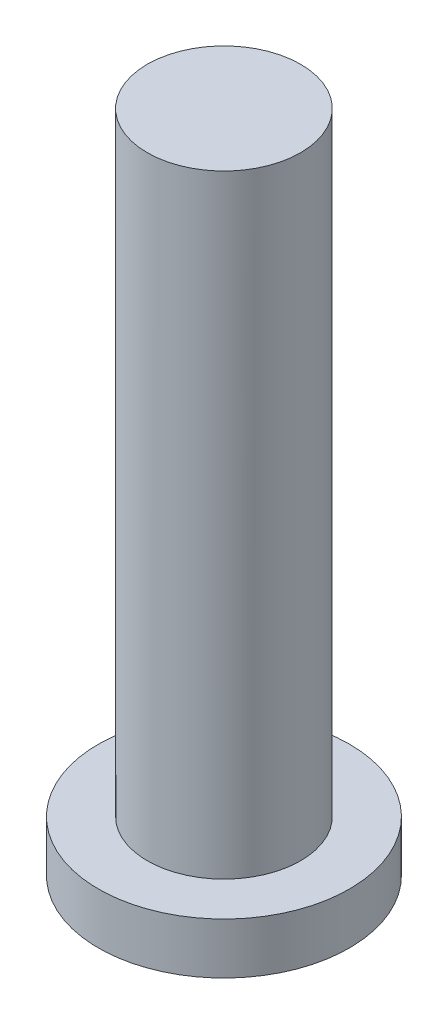
ISO-10303-21;
HEADER;
FILE_DESCRIPTION(('STEP AP214'),'2;1');
FILE_NAME('part.step','',(''),(''),'','','');
FILE_SCHEMA(('AUTOMOTIVE_DESIGN { 1 0 10303 214 1 1 1 1 }'));
ENDSEC;
DATA;
#1=APPLICATION_CONTEXT('core data for automotive mechanical design processes');
#2=APPLICATION_PROTOCOL_DEFINITION('international standard','automotive_design',2000,#1);
#3=PRODUCT_CONTEXT('',#1,'mechanical');
#4=PRODUCT('Part','Part','',(#3));
#5=PRODUCT_RELATED_PRODUCT_CATEGORY('part','',(#4));
#6=PRODUCT_DEFINITION_FORMATION('','',#4);
#7=PRODUCT_DEFINITION_CONTEXT('part definition',#1,'design');
#8=PRODUCT_DEFINITION('design','',#6,#7);
#9=PRODUCT_DEFINITION_SHAPE('','',#8);
#10=(LENGTH_UNIT() NAMED_UNIT(*) SI_UNIT(.MILLI.,.METRE.));
#11=(NAMED_UNIT(*) PLANE_ANGLE_UNIT() SI_UNIT($,.RADIAN.));
#12=(NAMED_UNIT(*) SI_UNIT($,.STERADIAN.) SOLID_ANGLE_UNIT());
#13=UNCERTAINTY_MEASURE_WITH_UNIT(LENGTH_MEASURE(1.E-05),#10,'distance_accuracy_value','');
#14=(GEOMETRIC_REPRESENTATION_CONTEXT(3) GLOBAL_UNCERTAINTY_ASSIGNED_CONTEXT((#13)) GLOBAL_UNIT_ASSIGNED_CONTEXT((#10,
#11,#12)) REPRESENTATION_CONTEXT('',''));
#15=CARTESIAN_POINT('',(0.,0.,0.));
#16=DIRECTION('',(0.,0.,1.));
#17=DIRECTION('',(1.,0.,0.));
#18=AXIS2_PLACEMENT_3D('',#15,#16,#17);
#19=CARTESIAN_POINT('',(0.,12.,0.));
#20=DIRECTION('',(0.,-1.,0.));
#21=DIRECTION('',(0.,0.,-1.));
#22=AXIS2_PLACEMENT_3D('',#19,#20,#21);
#23=CYLINDRICAL_SURFACE('',#22,1.5);
#24=CARTESIAN_POINT('',(0.,12.,0.));
#25=DIRECTION('',(0.,1.,0.));
#26=DIRECTION('',(0.,0.,1.));
#27=AXIS2_PLACEMENT_3D('',#24,#25,#26);
#28=CIRCLE('',#27,1.5);
#29=CARTESIAN_POINT('',(0.,12.,1.5));
#30=VERTEX_POINT('',#29);
#31=EDGE_CURVE('E10',#30,#30,#28,.T.);
#32=ORIENTED_EDGE('',*,*,#31,.F.);
#33=EDGE_LOOP('',(#32));
#34=FACE_BOUND('',#33,.T.);
#35=CARTESIAN_POINT('',(0.,0.,0.));
#36=DIRECTION('',(0.,-1.,0.));
#37=DIRECTION('',(0.,0.,-1.));
#38=AXIS2_PLACEMENT_3D('',#35,#36,#37);
#39=CIRCLE('',#38,1.5);
#40=CARTESIAN_POINT('',(0.,0.,-1.5));
#41=VERTEX_POINT('',#40);
#42=EDGE_CURVE('E37',#41,#41,#39,.T.);
#43=ORIENTED_EDGE('',*,*,#42,.F.);
#44=EDGE_LOOP('',(#43));
#45=FACE_BOUND('',#44,.T.);
#46=ADVANCED_FACE('F31',(#34,#45),#23,.T.);
#47=CARTESIAN_POINT('',(0.,12.,0.));
#48=DIRECTION('',(0.,1.,0.));
#49=DIRECTION('',(0.,0.,1.));
#50=AXIS2_PLACEMENT_3D('',#47,#48,#49);
#51=PLANE('',#50);
#52=ORIENTED_EDGE('',*,*,#31,.T.);
#53=EDGE_LOOP('',(#52));
#54=FACE_BOUND('',#53,.T.);
#55=ADVANCED_FACE('F64',(#54),#51,.T.);
#56=CARTESIAN_POINT('',(0.,-1.,0.));
#57=DIRECTION('',(0.,1.,0.));
#58=DIRECTION('',(0.,0.,1.));
#59=AXIS2_PLACEMENT_3D('',#56,#57,#58);
#60=CYLINDRICAL_SURFACE('',#59,2.45605775399772);
#61=CARTESIAN_POINT('',(0.,-1.,0.));
#62=DIRECTION('',(0.,-1.,0.));
#63=DIRECTION('',(0.,0.,-1.));
#64=AXIS2_PLACEMENT_3D('',#61,#62,#63);
#65=CIRCLE('',#64,2.45605775399772);
#66=CARTESIAN_POINT('',(0.,-1.,-2.45605775399772));
#67=VERTEX_POINT('',#66);
#68=EDGE_CURVE('E41',#67,#67,#65,.T.);
#69=ORIENTED_EDGE('',*,*,#68,.F.);
#70=EDGE_LOOP('',(#69));
#71=FACE_BOUND('',#70,.T.);
#72=CARTESIAN_POINT('',(0.,0.,0.));
#73=DIRECTION('',(0.,-1.,0.));
#74=DIRECTION('',(0.,0.,-1.));
#75=AXIS2_PLACEMENT_3D('',#72,#73,#74);
#76=CIRCLE('',#75,2.45605775399772);
#77=CARTESIAN_POINT('',(0.,0.,-2.45605775399772));
#78=VERTEX_POINT('',#77);
#79=EDGE_CURVE('E45',#78,#78,#76,.T.);
#80=ORIENTED_EDGE('',*,*,#79,.T.);
#81=EDGE_LOOP('',(#80));
#82=FACE_BOUND('',#81,.T.);
#83=ADVANCED_FACE('F51',(#71,#82),#60,.T.);
#84=CARTESIAN_POINT('',(0.,-1.,0.));
#85=DIRECTION('',(0.,-1.,0.));
#86=DIRECTION('',(0.,0.,-1.));
#87=AXIS2_PLACEMENT_3D('',#84,#85,#86);
#88=PLANE('',#87);
#89=ORIENTED_EDGE('',*,*,#68,.T.);
#90=EDGE_LOOP('',(#89));
#91=FACE_BOUND('',#90,.T.);
#92=ADVANCED_FACE('F55',(#91),#88,.T.);
#93=CARTESIAN_POINT('',(0.,0.,0.));
#94=DIRECTION('',(0.,-1.,0.));
#95=DIRECTION('',(0.,0.,-1.));
#96=AXIS2_PLACEMENT_3D('',#93,#94,#95);
#97=PLANE('',#96);
#98=ORIENTED_EDGE('',*,*,#42,.T.);
#99=EDGE_LOOP('',(#98));
#100=FACE_BOUND('',#99,.T.);
#101=ORIENTED_EDGE('',*,*,#79,.F.);
#102=EDGE_LOOP('',(#101));
#103=FACE_BOUND('',#102,.T.);
#104=ADVANCED_FACE('F53',(#100,#103),#97,.F.);
#105=CLOSED_SHELL('',(#46,#55,#83,#92,#104));
#106=MANIFOLD_SOLID_BREP('B2',#105);
#107=ADVANCED_BREP_SHAPE_REPRESENTATION('',(#18,#106),#14);
#108=SHAPE_DEFINITION_REPRESENTATION(#9,#107);
ENDSEC;
END-ISO-10303-21;
